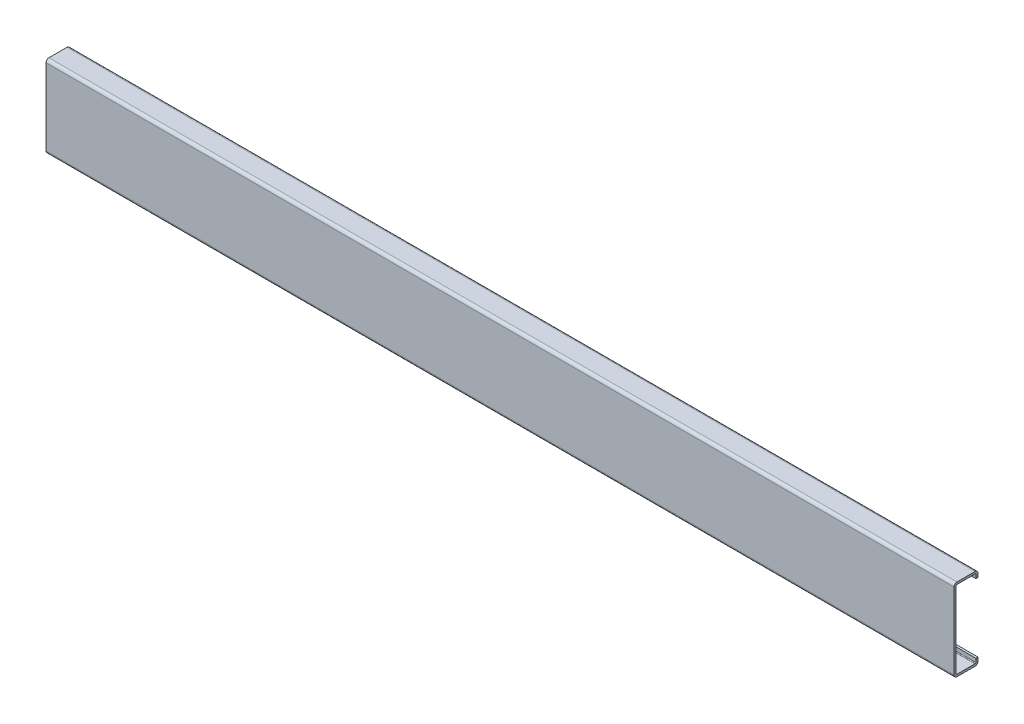
ISO-10303-21;
HEADER;
FILE_DESCRIPTION(('STEP AP214'),'2;1');
FILE_NAME('part.step','',(''),(''),'','','');
FILE_SCHEMA(('AUTOMOTIVE_DESIGN { 1 0 10303 214 1 1 1 1 }'));
ENDSEC;
DATA;
#1=APPLICATION_CONTEXT('core data for automotive mechanical design processes');
#2=APPLICATION_PROTOCOL_DEFINITION('international standard','automotive_design',2000,#1);
#3=PRODUCT_CONTEXT('',#1,'mechanical');
#4=PRODUCT('Part','Part','',(#3));
#5=PRODUCT_RELATED_PRODUCT_CATEGORY('part','',(#4));
#6=PRODUCT_DEFINITION_FORMATION('','',#4);
#7=PRODUCT_DEFINITION_CONTEXT('part definition',#1,'design');
#8=PRODUCT_DEFINITION('design','',#6,#7);
#9=PRODUCT_DEFINITION_SHAPE('','',#8);
#10=(LENGTH_UNIT() NAMED_UNIT(*) SI_UNIT(.MILLI.,.METRE.));
#11=(NAMED_UNIT(*) PLANE_ANGLE_UNIT() SI_UNIT($,.RADIAN.));
#12=(NAMED_UNIT(*) SI_UNIT($,.STERADIAN.) SOLID_ANGLE_UNIT());
#13=UNCERTAINTY_MEASURE_WITH_UNIT(LENGTH_MEASURE(1.E-05),#10,'distance_accuracy_value','');
#14=(GEOMETRIC_REPRESENTATION_CONTEXT(3) GLOBAL_UNCERTAINTY_ASSIGNED_CONTEXT((#13)) GLOBAL_UNIT_ASSIGNED_CONTEXT((#10,
#11,#12)) REPRESENTATION_CONTEXT('',''));
#15=CARTESIAN_POINT('',(0.,0.,0.));
#16=DIRECTION('',(0.,0.,1.));
#17=DIRECTION('',(1.,0.,0.));
#18=AXIS2_PLACEMENT_3D('',#15,#16,#17);
#19=CARTESIAN_POINT('',(500.,21.,-11.4));
#20=DIRECTION('',(0.,0.,-1.));
#21=DIRECTION('',(0.,1.,0.));
#22=AXIS2_PLACEMENT_3D('',#19,#20,#21);
#23=PLANE('',#22);
#24=DIRECTION('',(0.,-1.,0.));
#25=VECTOR('',#24,1.);
#26=CARTESIAN_POINT('',(0.,21.,-11.4));
#27=LINE('',#26,#25);
#28=CARTESIAN_POINT('',(0.,21.,-11.4));
#29=VERTEX_POINT('',#28);
#30=CARTESIAN_POINT('',(0.,19.,-11.4));
#31=VERTEX_POINT('',#30);
#32=EDGE_CURVE('E201',#29,#31,#27,.T.);
#33=ORIENTED_EDGE('',*,*,#32,.T.);
#34=DIRECTION('',(-1.,0.,0.));
#35=VECTOR('',#34,1.);
#36=CARTESIAN_POINT('',(500.,19.,-11.4));
#37=LINE('',#36,#35);
#38=CARTESIAN_POINT('',(500.,19.,-11.4));
#39=VERTEX_POINT('',#38);
#40=EDGE_CURVE('E11',#39,#31,#37,.T.);
#41=ORIENTED_EDGE('',*,*,#40,.F.);
#42=DIRECTION('',(0.,-1.,0.));
#43=VECTOR('',#42,1.);
#44=CARTESIAN_POINT('',(500.,21.,-11.4));
#45=LINE('',#44,#43);
#46=CARTESIAN_POINT('',(500.,21.,-11.4));
#47=VERTEX_POINT('',#46);
#48=EDGE_CURVE('E126',#47,#39,#45,.T.);
#49=ORIENTED_EDGE('',*,*,#48,.F.);
#50=DIRECTION('',(-1.,0.,0.));
#51=VECTOR('',#50,1.);
#52=CARTESIAN_POINT('',(500.,21.,-11.4));
#53=LINE('',#52,#51);
#54=EDGE_CURVE('E197',#47,#29,#53,.T.);
#55=ORIENTED_EDGE('',*,*,#54,.T.);
#56=EDGE_LOOP('',(#33,#41,#49,#55));
#57=FACE_BOUND('',#56,.T.);
#58=ADVANCED_FACE('F34',(#57),#23,.F.);
#59=CARTESIAN_POINT('',(500.,19.,-12.6));
#60=DIRECTION('',(0.,-1.,0.));
#61=DIRECTION('',(0.,0.,-1.));
#62=AXIS2_PLACEMENT_3D('',#59,#60,#61);
#63=PLANE('',#62);
#64=DIRECTION('',(0.,0.,1.));
#65=VECTOR('',#64,1.);
#66=CARTESIAN_POINT('',(0.,19.,-12.6));
#67=LINE('',#66,#65);
#68=CARTESIAN_POINT('',(0.,19.,-12.6));
#69=VERTEX_POINT('',#68);
#70=EDGE_CURVE('E204',#69,#31,#67,.T.);
#71=ORIENTED_EDGE('',*,*,#70,.F.);
#72=DIRECTION('',(-1.,0.,0.));
#73=VECTOR('',#72,1.);
#74=CARTESIAN_POINT('',(500.,19.,-12.6));
#75=LINE('',#74,#73);
#76=CARTESIAN_POINT('',(500.,19.,-12.6));
#77=VERTEX_POINT('',#76);
#78=EDGE_CURVE('E42',#77,#69,#75,.T.);
#79=ORIENTED_EDGE('',*,*,#78,.F.);
#80=DIRECTION('',(0.,0.,1.));
#81=VECTOR('',#80,1.);
#82=CARTESIAN_POINT('',(500.,19.,-12.6));
#83=LINE('',#82,#81);
#84=EDGE_CURVE('E306',#77,#39,#83,.T.);
#85=ORIENTED_EDGE('',*,*,#84,.T.);
#86=ORIENTED_EDGE('',*,*,#40,.T.);
#87=EDGE_LOOP('',(#71,#79,#85,#86));
#88=FACE_BOUND('',#87,.T.);
#89=ADVANCED_FACE('F293',(#88),#63,.T.);
#90=CARTESIAN_POINT('',(500.,21.,-12.6));
#91=DIRECTION('',(0.,0.,-1.));
#92=DIRECTION('',(0.,1.,0.));
#93=AXIS2_PLACEMENT_3D('',#90,#91,#92);
#94=PLANE('',#93);
#95=DIRECTION('',(0.,-1.,0.));
#96=VECTOR('',#95,1.);
#97=CARTESIAN_POINT('',(0.,21.,-12.6));
#98=LINE('',#97,#96);
#99=CARTESIAN_POINT('',(0.,21.,-12.6));
#100=VERTEX_POINT('',#99);
#101=EDGE_CURVE('E207',#100,#69,#98,.T.);
#102=ORIENTED_EDGE('',*,*,#101,.F.);
#103=DIRECTION('',(-1.,0.,0.));
#104=VECTOR('',#103,1.);
#105=CARTESIAN_POINT('',(500.,21.,-12.6));
#106=LINE('',#105,#104);
#107=CARTESIAN_POINT('',(500.,21.,-12.6));
#108=VERTEX_POINT('',#107);
#109=EDGE_CURVE('E283',#108,#100,#106,.T.);
#110=ORIENTED_EDGE('',*,*,#109,.F.);
#111=DIRECTION('',(0.,-1.,0.));
#112=VECTOR('',#111,1.);
#113=CARTESIAN_POINT('',(500.,21.,-12.6));
#114=LINE('',#113,#112);
#115=EDGE_CURVE('E290',#108,#77,#114,.T.);
#116=ORIENTED_EDGE('',*,*,#115,.T.);
#117=ORIENTED_EDGE('',*,*,#78,.T.);
#118=EDGE_LOOP('',(#102,#110,#116,#117));
#119=FACE_BOUND('',#118,.T.);
#120=ADVANCED_FACE('F288',(#119),#94,.T.);
#121=CARTESIAN_POINT('',(500.,21.,-11.));
#122=DIRECTION('',(-1.,0.,0.));
#123=DIRECTION('',(0.,0.,1.));
#124=AXIS2_PLACEMENT_3D('',#121,#122,#123);
#125=CYLINDRICAL_SURFACE('',#124,1.6);
#126=CARTESIAN_POINT('',(0.,21.,-11.));
#127=DIRECTION('',(1.,0.,0.));
#128=DIRECTION('',(0.,0.,-1.));
#129=AXIS2_PLACEMENT_3D('',#126,#127,#128);
#130=CIRCLE('',#129,1.6);
#131=CARTESIAN_POINT('',(0.,22.6,-11.));
#132=VERTEX_POINT('',#131);
#133=EDGE_CURVE('E210',#132,#100,#130,.F.);
#134=ORIENTED_EDGE('',*,*,#133,.F.);
#135=DIRECTION('',(-1.,0.,0.));
#136=VECTOR('',#135,1.);
#137=CARTESIAN_POINT('',(500.,22.6,-11.));
#138=LINE('',#137,#136);
#139=CARTESIAN_POINT('',(500.,22.6,-11.));
#140=VERTEX_POINT('',#139);
#141=EDGE_CURVE('E281',#140,#132,#138,.T.);
#142=ORIENTED_EDGE('',*,*,#141,.F.);
#143=CARTESIAN_POINT('',(500.,21.,-11.));
#144=DIRECTION('',(1.,0.,0.));
#145=DIRECTION('',(0.,0.,-1.));
#146=AXIS2_PLACEMENT_3D('',#143,#144,#145);
#147=CIRCLE('',#146,1.6);
#148=EDGE_CURVE('E303',#140,#108,#147,.F.);
#149=ORIENTED_EDGE('',*,*,#148,.T.);
#150=ORIENTED_EDGE('',*,*,#109,.T.);
#151=EDGE_LOOP('',(#134,#142,#149,#150));
#152=FACE_BOUND('',#151,.T.);
#153=ADVANCED_FACE('F300',(#152),#125,.T.);
#154=CARTESIAN_POINT('',(500.,22.6,-1.));
#155=DIRECTION('',(0.,1.,0.));
#156=DIRECTION('',(0.,0.,1.));
#157=AXIS2_PLACEMENT_3D('',#154,#155,#156);
#158=PLANE('',#157);
#159=DIRECTION('',(0.,0.,-1.));
#160=VECTOR('',#159,1.);
#161=CARTESIAN_POINT('',(0.,22.6,-1.));
#162=LINE('',#161,#160);
#163=CARTESIAN_POINT('',(0.,22.6,-1.));
#164=VERTEX_POINT('',#163);
#165=EDGE_CURVE('E213',#164,#132,#162,.T.);
#166=ORIENTED_EDGE('',*,*,#165,.F.);
#167=DIRECTION('',(-1.,0.,0.));
#168=VECTOR('',#167,1.);
#169=CARTESIAN_POINT('',(500.,22.6,-1.));
#170=LINE('',#169,#168);
#171=CARTESIAN_POINT('',(500.,22.6,-1.));
#172=VERTEX_POINT('',#171);
#173=EDGE_CURVE('E279',#172,#164,#170,.T.);
#174=ORIENTED_EDGE('',*,*,#173,.F.);
#175=DIRECTION('',(0.,0.,-1.));
#176=VECTOR('',#175,1.);
#177=CARTESIAN_POINT('',(500.,22.6,-1.));
#178=LINE('',#177,#176);
#179=EDGE_CURVE('E308',#172,#140,#178,.T.);
#180=ORIENTED_EDGE('',*,*,#179,.T.);
#181=ORIENTED_EDGE('',*,*,#141,.T.);
#182=EDGE_LOOP('',(#166,#174,#180,#181));
#183=FACE_BOUND('',#182,.T.);
#184=ADVANCED_FACE('F374',(#183),#158,.T.);
#185=CARTESIAN_POINT('',(500.,21.,-1.));
#186=DIRECTION('',(-1.,0.,0.));
#187=DIRECTION('',(0.,0.,1.));
#188=AXIS2_PLACEMENT_3D('',#185,#186,#187);
#189=CYLINDRICAL_SURFACE('',#188,1.6);
#190=CARTESIAN_POINT('',(0.,21.,-1.));
#191=DIRECTION('',(1.,0.,0.));
#192=DIRECTION('',(0.,0.,-1.));
#193=AXIS2_PLACEMENT_3D('',#190,#191,#192);
#194=CIRCLE('',#193,1.6);
#195=CARTESIAN_POINT('',(0.,21.,0.6));
#196=VERTEX_POINT('',#195);
#197=EDGE_CURVE('E216',#196,#164,#194,.F.);
#198=ORIENTED_EDGE('',*,*,#197,.F.);
#199=DIRECTION('',(-1.,0.,0.));
#200=VECTOR('',#199,1.);
#201=CARTESIAN_POINT('',(500.,21.,0.6));
#202=LINE('',#201,#200);
#203=CARTESIAN_POINT('',(500.,21.,0.6));
#204=VERTEX_POINT('',#203);
#205=EDGE_CURVE('E277',#204,#196,#202,.T.);
#206=ORIENTED_EDGE('',*,*,#205,.F.);
#207=CARTESIAN_POINT('',(500.,21.,-1.));
#208=DIRECTION('',(1.,0.,0.));
#209=DIRECTION('',(0.,0.,-1.));
#210=AXIS2_PLACEMENT_3D('',#207,#208,#209);
#211=CIRCLE('',#210,1.6);
#212=EDGE_CURVE('E314',#204,#172,#211,.F.);
#213=ORIENTED_EDGE('',*,*,#212,.T.);
#214=ORIENTED_EDGE('',*,*,#173,.T.);
#215=EDGE_LOOP('',(#198,#206,#213,#214));
#216=FACE_BOUND('',#215,.T.);
#217=ADVANCED_FACE('F377',(#216),#189,.T.);
#218=CARTESIAN_POINT('',(500.,-21.,0.6));
#219=DIRECTION('',(0.,0.,1.));
#220=DIRECTION('',(1.,0.,0.));
#221=AXIS2_PLACEMENT_3D('',#218,#219,#220);
#222=PLANE('',#221);
#223=DIRECTION('',(0.,1.,0.));
#224=VECTOR('',#223,1.);
#225=CARTESIAN_POINT('',(0.,-21.,0.6));
#226=LINE('',#225,#224);
#227=CARTESIAN_POINT('',(0.,-21.,0.6));
#228=VERTEX_POINT('',#227);
#229=EDGE_CURVE('E219',#228,#196,#226,.T.);
#230=ORIENTED_EDGE('',*,*,#229,.F.);
#231=DIRECTION('',(-1.,0.,0.));
#232=VECTOR('',#231,1.);
#233=CARTESIAN_POINT('',(500.,-21.,0.6));
#234=LINE('',#233,#232);
#235=CARTESIAN_POINT('',(500.,-21.,0.6));
#236=VERTEX_POINT('',#235);
#237=EDGE_CURVE('E275',#236,#228,#234,.T.);
#238=ORIENTED_EDGE('',*,*,#237,.F.);
#239=DIRECTION('',(0.,1.,0.));
#240=VECTOR('',#239,1.);
#241=CARTESIAN_POINT('',(500.,-21.,0.6));
#242=LINE('',#241,#240);
#243=EDGE_CURVE('E317',#236,#204,#242,.T.);
#244=ORIENTED_EDGE('',*,*,#243,.T.);
#245=ORIENTED_EDGE('',*,*,#205,.T.);
#246=EDGE_LOOP('',(#230,#238,#244,#245));
#247=FACE_BOUND('',#246,.T.);
#248=ADVANCED_FACE('F381',(#247),#222,.T.);
#249=CARTESIAN_POINT('',(500.,-21.,-1.));
#250=DIRECTION('',(-1.,0.,0.));
#251=DIRECTION('',(0.,0.,1.));
#252=AXIS2_PLACEMENT_3D('',#249,#250,#251);
#253=CYLINDRICAL_SURFACE('',#252,1.6);
#254=CARTESIAN_POINT('',(0.,-21.,-1.));
#255=DIRECTION('',(1.,0.,0.));
#256=DIRECTION('',(0.,0.,-1.));
#257=AXIS2_PLACEMENT_3D('',#254,#255,#256);
#258=CIRCLE('',#257,1.6);
#259=CARTESIAN_POINT('',(0.,-22.6,-1.));
#260=VERTEX_POINT('',#259);
#261=EDGE_CURVE('E222',#260,#228,#258,.F.);
#262=ORIENTED_EDGE('',*,*,#261,.F.);
#263=DIRECTION('',(-1.,0.,0.));
#264=VECTOR('',#263,1.);
#265=CARTESIAN_POINT('',(500.,-22.6,-1.));
#266=LINE('',#265,#264);
#267=CARTESIAN_POINT('',(500.,-22.6,-1.));
#268=VERTEX_POINT('',#267);
#269=EDGE_CURVE('E273',#268,#260,#266,.T.);
#270=ORIENTED_EDGE('',*,*,#269,.F.);
#271=CARTESIAN_POINT('',(500.,-21.,-1.));
#272=DIRECTION('',(1.,0.,0.));
#273=DIRECTION('',(0.,0.,-1.));
#274=AXIS2_PLACEMENT_3D('',#271,#272,#273);
#275=CIRCLE('',#274,1.6);
#276=EDGE_CURVE('E320',#268,#236,#275,.F.);
#277=ORIENTED_EDGE('',*,*,#276,.T.);
#278=ORIENTED_EDGE('',*,*,#237,.T.);
#279=EDGE_LOOP('',(#262,#270,#277,#278));
#280=FACE_BOUND('',#279,.T.);
#281=ADVANCED_FACE('F385',(#280),#253,.T.);
#282=CARTESIAN_POINT('',(500.,-22.6,-1.));
#283=DIRECTION('',(0.,-1.,0.));
#284=DIRECTION('',(0.,0.,-1.));
#285=AXIS2_PLACEMENT_3D('',#282,#283,#284);
#286=PLANE('',#285);
#287=DIRECTION('',(0.,0.,-1.));
#288=VECTOR('',#287,1.);
#289=CARTESIAN_POINT('',(0.,-22.6,-1.));
#290=LINE('',#289,#288);
#291=CARTESIAN_POINT('',(0.,-22.6,-11.));
#292=VERTEX_POINT('',#291);
#293=EDGE_CURVE('E225',#292,#260,#290,.F.);
#294=ORIENTED_EDGE('',*,*,#293,.F.);
#295=DIRECTION('',(-1.,0.,0.));
#296=VECTOR('',#295,1.);
#297=CARTESIAN_POINT('',(500.,-22.6,-11.));
#298=LINE('',#297,#296);
#299=CARTESIAN_POINT('',(500.,-22.6,-11.));
#300=VERTEX_POINT('',#299);
#301=EDGE_CURVE('E271',#300,#292,#298,.T.);
#302=ORIENTED_EDGE('',*,*,#301,.F.);
#303=DIRECTION('',(0.,0.,-1.));
#304=VECTOR('',#303,1.);
#305=CARTESIAN_POINT('',(500.,-22.6,-1.));
#306=LINE('',#305,#304);
#307=EDGE_CURVE('E323',#300,#268,#306,.F.);
#308=ORIENTED_EDGE('',*,*,#307,.T.);
#309=ORIENTED_EDGE('',*,*,#269,.T.);
#310=EDGE_LOOP('',(#294,#302,#308,#309));
#311=FACE_BOUND('',#310,.T.);
#312=ADVANCED_FACE('F389',(#311),#286,.T.);
#313=CARTESIAN_POINT('',(500.,-21.,-11.));
#314=DIRECTION('',(-1.,0.,0.));
#315=DIRECTION('',(0.,0.,1.));
#316=AXIS2_PLACEMENT_3D('',#313,#314,#315);
#317=CYLINDRICAL_SURFACE('',#316,1.6);
#318=CARTESIAN_POINT('',(0.,-21.,-11.));
#319=DIRECTION('',(1.,0.,0.));
#320=DIRECTION('',(0.,0.,-1.));
#321=AXIS2_PLACEMENT_3D('',#318,#319,#320);
#322=CIRCLE('',#321,1.6);
#323=CARTESIAN_POINT('',(0.,-21.,-12.6));
#324=VERTEX_POINT('',#323);
#325=EDGE_CURVE('E228',#324,#292,#322,.F.);
#326=ORIENTED_EDGE('',*,*,#325,.F.);
#327=DIRECTION('',(-1.,0.,0.));
#328=VECTOR('',#327,1.);
#329=CARTESIAN_POINT('',(500.,-21.,-12.6));
#330=LINE('',#329,#328);
#331=CARTESIAN_POINT('',(500.,-21.,-12.6));
#332=VERTEX_POINT('',#331);
#333=EDGE_CURVE('E269',#332,#324,#330,.T.);
#334=ORIENTED_EDGE('',*,*,#333,.F.);
#335=CARTESIAN_POINT('',(500.,-21.,-11.));
#336=DIRECTION('',(1.,0.,0.));
#337=DIRECTION('',(0.,0.,-1.));
#338=AXIS2_PLACEMENT_3D('',#335,#336,#337);
#339=CIRCLE('',#338,1.6);
#340=EDGE_CURVE('E326',#332,#300,#339,.F.);
#341=ORIENTED_EDGE('',*,*,#340,.T.);
#342=ORIENTED_EDGE('',*,*,#301,.T.);
#343=EDGE_LOOP('',(#326,#334,#341,#342));
#344=FACE_BOUND('',#343,.T.);
#345=ADVANCED_FACE('F393',(#344),#317,.T.);
#346=CARTESIAN_POINT('',(500.,-21.,-12.6));
#347=DIRECTION('',(0.,0.,-1.));
#348=DIRECTION('',(0.,1.,0.));
#349=AXIS2_PLACEMENT_3D('',#346,#347,#348);
#350=PLANE('',#349);
#351=DIRECTION('',(0.,-1.,0.));
#352=VECTOR('',#351,1.);
#353=CARTESIAN_POINT('',(0.,-21.,-12.6));
#354=LINE('',#353,#352);
#355=CARTESIAN_POINT('',(0.,-19.,-12.6));
#356=VERTEX_POINT('',#355);
#357=EDGE_CURVE('E231',#356,#324,#354,.T.);
#358=ORIENTED_EDGE('',*,*,#357,.F.);
#359=DIRECTION('',(-1.,0.,0.));
#360=VECTOR('',#359,1.);
#361=CARTESIAN_POINT('',(500.,-19.,-12.6));
#362=LINE('',#361,#360);
#363=CARTESIAN_POINT('',(500.,-19.,-12.6));
#364=VERTEX_POINT('',#363);
#365=EDGE_CURVE('E267',#364,#356,#362,.T.);
#366=ORIENTED_EDGE('',*,*,#365,.F.);
#367=DIRECTION('',(0.,-1.,0.));
#368=VECTOR('',#367,1.);
#369=CARTESIAN_POINT('',(500.,-21.,-12.6));
#370=LINE('',#369,#368);
#371=EDGE_CURVE('E329',#364,#332,#370,.T.);
#372=ORIENTED_EDGE('',*,*,#371,.T.);
#373=ORIENTED_EDGE('',*,*,#333,.T.);
#374=EDGE_LOOP('',(#358,#366,#372,#373));
#375=FACE_BOUND('',#374,.T.);
#376=ADVANCED_FACE('F397',(#375),#350,.T.);
#377=CARTESIAN_POINT('',(500.,-19.,-11.4));
#378=DIRECTION('',(0.,1.,0.));
#379=DIRECTION('',(0.,0.,1.));
#380=AXIS2_PLACEMENT_3D('',#377,#378,#379);
#381=PLANE('',#380);
#382=DIRECTION('',(0.,0.,-1.));
#383=VECTOR('',#382,1.);
#384=CARTESIAN_POINT('',(0.,-19.,-11.4));
#385=LINE('',#384,#383);
#386=CARTESIAN_POINT('',(0.,-19.,-11.4));
#387=VERTEX_POINT('',#386);
#388=EDGE_CURVE('E234',#387,#356,#385,.T.);
#389=ORIENTED_EDGE('',*,*,#388,.F.);
#390=DIRECTION('',(-1.,0.,0.));
#391=VECTOR('',#390,1.);
#392=CARTESIAN_POINT('',(500.,-19.,-11.4));
#393=LINE('',#392,#391);
#394=CARTESIAN_POINT('',(500.,-19.,-11.4));
#395=VERTEX_POINT('',#394);
#396=EDGE_CURVE('E265',#395,#387,#393,.T.);
#397=ORIENTED_EDGE('',*,*,#396,.F.);
#398=DIRECTION('',(0.,0.,-1.));
#399=VECTOR('',#398,1.);
#400=CARTESIAN_POINT('',(500.,-19.,-11.4));
#401=LINE('',#400,#399);
#402=EDGE_CURVE('E332',#395,#364,#401,.T.);
#403=ORIENTED_EDGE('',*,*,#402,.T.);
#404=ORIENTED_EDGE('',*,*,#365,.T.);
#405=EDGE_LOOP('',(#389,#397,#403,#404));
#406=FACE_BOUND('',#405,.T.);
#407=ADVANCED_FACE('F401',(#406),#381,.T.);
#408=CARTESIAN_POINT('',(500.,-21.,-11.4));
#409=DIRECTION('',(0.,0.,-1.));
#410=DIRECTION('',(0.,1.,0.));
#411=AXIS2_PLACEMENT_3D('',#408,#409,#410);
#412=PLANE('',#411);
#413=DIRECTION('',(0.,-1.,0.));
#414=VECTOR('',#413,1.);
#415=CARTESIAN_POINT('',(0.,-21.,-11.4));
#416=LINE('',#415,#414);
#417=CARTESIAN_POINT('',(0.,-21.,-11.4));
#418=VERTEX_POINT('',#417);
#419=EDGE_CURVE('E237',#387,#418,#416,.T.);
#420=ORIENTED_EDGE('',*,*,#419,.T.);
#421=DIRECTION('',(-1.,0.,0.));
#422=VECTOR('',#421,1.);
#423=CARTESIAN_POINT('',(500.,-21.,-11.4));
#424=LINE('',#423,#422);
#425=CARTESIAN_POINT('',(500.,-21.,-11.4));
#426=VERTEX_POINT('',#425);
#427=EDGE_CURVE('E262',#426,#418,#424,.T.);
#428=ORIENTED_EDGE('',*,*,#427,.F.);
#429=DIRECTION('',(0.,-1.,0.));
#430=VECTOR('',#429,1.);
#431=CARTESIAN_POINT('',(500.,-21.,-11.4));
#432=LINE('',#431,#430);
#433=EDGE_CURVE('E335',#395,#426,#432,.T.);
#434=ORIENTED_EDGE('',*,*,#433,.F.);
#435=ORIENTED_EDGE('',*,*,#396,.T.);
#436=EDGE_LOOP('',(#420,#428,#434,#435));
#437=FACE_BOUND('',#436,.T.);
#438=ADVANCED_FACE('F405',(#437),#412,.F.);
#439=CARTESIAN_POINT('',(500.,-21.,-11.));
#440=DIRECTION('',(-1.,0.,0.));
#441=DIRECTION('',(0.,0.,1.));
#442=AXIS2_PLACEMENT_3D('',#439,#440,#441);
#443=CYLINDRICAL_SURFACE('',#442,0.400000000000003);
#444=CARTESIAN_POINT('',(0.,-21.,-11.));
#445=DIRECTION('',(1.,0.,0.));
#446=DIRECTION('',(0.,0.,-1.));
#447=AXIS2_PLACEMENT_3D('',#444,#445,#446);
#448=CIRCLE('',#447,0.400000000000003);
#449=CARTESIAN_POINT('',(0.,-21.4,-11.));
#450=VERTEX_POINT('',#449);
#451=EDGE_CURVE('E239',#418,#450,#448,.F.);
#452=ORIENTED_EDGE('',*,*,#451,.T.);
#453=DIRECTION('',(-1.,0.,0.));
#454=VECTOR('',#453,1.);
#455=CARTESIAN_POINT('',(500.,-21.4,-11.));
#456=LINE('',#455,#454);
#457=CARTESIAN_POINT('',(500.,-21.4,-11.));
#458=VERTEX_POINT('',#457);
#459=EDGE_CURVE('E259',#458,#450,#456,.T.);
#460=ORIENTED_EDGE('',*,*,#459,.F.);
#461=CARTESIAN_POINT('',(500.,-21.,-11.));
#462=DIRECTION('',(1.,0.,0.));
#463=DIRECTION('',(0.,0.,-1.));
#464=AXIS2_PLACEMENT_3D('',#461,#462,#463);
#465=CIRCLE('',#464,0.400000000000003);
#466=EDGE_CURVE('E337',#426,#458,#465,.F.);
#467=ORIENTED_EDGE('',*,*,#466,.F.);
#468=ORIENTED_EDGE('',*,*,#427,.T.);
#469=EDGE_LOOP('',(#452,#460,#467,#468));
#470=FACE_BOUND('',#469,.T.);
#471=ADVANCED_FACE('F409',(#470),#443,.F.);
#472=CARTESIAN_POINT('',(500.,-21.4,-1.));
#473=DIRECTION('',(0.,-1.,0.));
#474=DIRECTION('',(0.,0.,-1.));
#475=AXIS2_PLACEMENT_3D('',#472,#473,#474);
#476=PLANE('',#475);
#477=DIRECTION('',(0.,0.,-1.));
#478=VECTOR('',#477,1.);
#479=CARTESIAN_POINT('',(0.,-21.4,-1.));
#480=LINE('',#479,#478);
#481=CARTESIAN_POINT('',(0.,-21.4,-1.));
#482=VERTEX_POINT('',#481);
#483=EDGE_CURVE('E241',#450,#482,#480,.F.);
#484=ORIENTED_EDGE('',*,*,#483,.T.);
#485=DIRECTION('',(-1.,0.,0.));
#486=VECTOR('',#485,1.);
#487=CARTESIAN_POINT('',(500.,-21.4,-1.));
#488=LINE('',#487,#486);
#489=CARTESIAN_POINT('',(500.,-21.4,-1.));
#490=VERTEX_POINT('',#489);
#491=EDGE_CURVE('E256',#490,#482,#488,.T.);
#492=ORIENTED_EDGE('',*,*,#491,.F.);
#493=DIRECTION('',(0.,0.,-1.));
#494=VECTOR('',#493,1.);
#495=CARTESIAN_POINT('',(500.,-21.4,-1.));
#496=LINE('',#495,#494);
#497=EDGE_CURVE('E339',#458,#490,#496,.F.);
#498=ORIENTED_EDGE('',*,*,#497,.F.);
#499=ORIENTED_EDGE('',*,*,#459,.T.);
#500=EDGE_LOOP('',(#484,#492,#498,#499));
#501=FACE_BOUND('',#500,.T.);
#502=ADVANCED_FACE('F413',(#501),#476,.F.);
#503=CARTESIAN_POINT('',(500.,-21.,-1.));
#504=DIRECTION('',(-1.,0.,0.));
#505=DIRECTION('',(0.,0.,1.));
#506=AXIS2_PLACEMENT_3D('',#503,#504,#505);
#507=CYLINDRICAL_SURFACE('',#506,0.400000000000001);
#508=CARTESIAN_POINT('',(0.,-21.,-1.));
#509=DIRECTION('',(1.,0.,0.));
#510=DIRECTION('',(0.,0.,-1.));
#511=AXIS2_PLACEMENT_3D('',#508,#509,#510);
#512=CIRCLE('',#511,0.400000000000001);
#513=CARTESIAN_POINT('',(0.,-21.,-0.6));
#514=VERTEX_POINT('',#513);
#515=EDGE_CURVE('E243',#482,#514,#512,.F.);
#516=ORIENTED_EDGE('',*,*,#515,.T.);
#517=DIRECTION('',(-1.,0.,0.));
#518=VECTOR('',#517,1.);
#519=CARTESIAN_POINT('',(500.,-21.,-0.6));
#520=LINE('',#519,#518);
#521=CARTESIAN_POINT('',(500.,-21.,-0.6));
#522=VERTEX_POINT('',#521);
#523=EDGE_CURVE('E253',#522,#514,#520,.T.);
#524=ORIENTED_EDGE('',*,*,#523,.F.);
#525=CARTESIAN_POINT('',(500.,-21.,-1.));
#526=DIRECTION('',(1.,0.,0.));
#527=DIRECTION('',(0.,0.,-1.));
#528=AXIS2_PLACEMENT_3D('',#525,#526,#527);
#529=CIRCLE('',#528,0.400000000000001);
#530=EDGE_CURVE('E341',#490,#522,#529,.F.);
#531=ORIENTED_EDGE('',*,*,#530,.F.);
#532=ORIENTED_EDGE('',*,*,#491,.T.);
#533=EDGE_LOOP('',(#516,#524,#531,#532));
#534=FACE_BOUND('',#533,.T.);
#535=ADVANCED_FACE('F347',(#534),#507,.F.);
#536=CARTESIAN_POINT('',(500.,-21.,-0.6));
#537=DIRECTION('',(0.,0.,1.));
#538=DIRECTION('',(1.,0.,0.));
#539=AXIS2_PLACEMENT_3D('',#536,#537,#538);
#540=PLANE('',#539);
#541=DIRECTION('',(0.,1.,0.));
#542=VECTOR('',#541,1.);
#543=CARTESIAN_POINT('',(0.,-21.,-0.6));
#544=LINE('',#543,#542);
#545=CARTESIAN_POINT('',(0.,21.,-0.6));
#546=VERTEX_POINT('',#545);
#547=EDGE_CURVE('E245',#514,#546,#544,.T.);
#548=ORIENTED_EDGE('',*,*,#547,.T.);
#549=DIRECTION('',(-1.,0.,0.));
#550=VECTOR('',#549,1.);
#551=CARTESIAN_POINT('',(500.,21.,-0.6));
#552=LINE('',#551,#550);
#553=CARTESIAN_POINT('',(500.,21.,-0.6));
#554=VERTEX_POINT('',#553);
#555=EDGE_CURVE('E192',#554,#546,#552,.T.);
#556=ORIENTED_EDGE('',*,*,#555,.F.);
#557=DIRECTION('',(0.,1.,0.));
#558=VECTOR('',#557,1.);
#559=CARTESIAN_POINT('',(500.,-21.,-0.6));
#560=LINE('',#559,#558);
#561=EDGE_CURVE('E183',#522,#554,#560,.T.);
#562=ORIENTED_EDGE('',*,*,#561,.F.);
#563=ORIENTED_EDGE('',*,*,#523,.T.);
#564=EDGE_LOOP('',(#548,#556,#562,#563));
#565=FACE_BOUND('',#564,.T.);
#566=ADVANCED_FACE('F351',(#565),#540,.F.);
#567=CARTESIAN_POINT('',(500.,21.,-1.));
#568=DIRECTION('',(-1.,0.,0.));
#569=DIRECTION('',(0.,0.,1.));
#570=AXIS2_PLACEMENT_3D('',#567,#568,#569);
#571=CYLINDRICAL_SURFACE('',#570,0.400000000000001);
#572=CARTESIAN_POINT('',(0.,21.,-1.));
#573=DIRECTION('',(1.,0.,0.));
#574=DIRECTION('',(0.,0.,-1.));
#575=AXIS2_PLACEMENT_3D('',#572,#573,#574);
#576=CIRCLE('',#575,0.400000000000001);
#577=CARTESIAN_POINT('',(0.,21.4,-1.));
#578=VERTEX_POINT('',#577);
#579=EDGE_CURVE('E191',#546,#578,#576,.F.);
#580=ORIENTED_EDGE('',*,*,#579,.T.);
#581=DIRECTION('',(-1.,0.,0.));
#582=VECTOR('',#581,1.);
#583=CARTESIAN_POINT('',(500.,21.4,-1.));
#584=LINE('',#583,#582);
#585=CARTESIAN_POINT('',(500.,21.4,-1.));
#586=VERTEX_POINT('',#585);
#587=EDGE_CURVE('E188',#586,#578,#584,.T.);
#588=ORIENTED_EDGE('',*,*,#587,.F.);
#589=CARTESIAN_POINT('',(500.,21.,-1.));
#590=DIRECTION('',(1.,0.,0.));
#591=DIRECTION('',(0.,0.,-1.));
#592=AXIS2_PLACEMENT_3D('',#589,#590,#591);
#593=CIRCLE('',#592,0.400000000000001);
#594=EDGE_CURVE('E177',#554,#586,#593,.F.);
#595=ORIENTED_EDGE('',*,*,#594,.F.);
#596=ORIENTED_EDGE('',*,*,#555,.T.);
#597=EDGE_LOOP('',(#580,#588,#595,#596));
#598=FACE_BOUND('',#597,.T.);
#599=ADVANCED_FACE('F189',(#598),#571,.F.);
#600=CARTESIAN_POINT('',(500.,21.4,-1.));
#601=DIRECTION('',(0.,1.,0.));
#602=DIRECTION('',(0.,0.,1.));
#603=AXIS2_PLACEMENT_3D('',#600,#601,#602);
#604=PLANE('',#603);
#605=DIRECTION('',(0.,0.,-1.));
#606=VECTOR('',#605,1.);
#607=CARTESIAN_POINT('',(0.,21.4,-1.));
#608=LINE('',#607,#606);
#609=CARTESIAN_POINT('',(0.,21.4,-11.));
#610=VERTEX_POINT('',#609);
#611=EDGE_CURVE('E114',#578,#610,#608,.T.);
#612=ORIENTED_EDGE('',*,*,#611,.T.);
#613=DIRECTION('',(-1.,0.,0.));
#614=VECTOR('',#613,1.);
#615=CARTESIAN_POINT('',(500.,21.4,-11.));
#616=LINE('',#615,#614);
#617=CARTESIAN_POINT('',(500.,21.4,-11.));
#618=VERTEX_POINT('',#617);
#619=EDGE_CURVE('E193',#618,#610,#616,.T.);
#620=ORIENTED_EDGE('',*,*,#619,.F.);
#621=DIRECTION('',(0.,0.,-1.));
#622=VECTOR('',#621,1.);
#623=CARTESIAN_POINT('',(500.,21.4,-1.));
#624=LINE('',#623,#622);
#625=EDGE_CURVE('E181',#586,#618,#624,.T.);
#626=ORIENTED_EDGE('',*,*,#625,.F.);
#627=ORIENTED_EDGE('',*,*,#587,.T.);
#628=EDGE_LOOP('',(#612,#620,#626,#627));
#629=FACE_BOUND('',#628,.T.);
#630=ADVANCED_FACE('F195',(#629),#604,.F.);
#631=CARTESIAN_POINT('',(500.,21.,-11.));
#632=DIRECTION('',(-1.,0.,0.));
#633=DIRECTION('',(0.,0.,1.));
#634=AXIS2_PLACEMENT_3D('',#631,#632,#633);
#635=CYLINDRICAL_SURFACE('',#634,0.400000000000003);
#636=CARTESIAN_POINT('',(0.,21.,-11.));
#637=DIRECTION('',(1.,0.,0.));
#638=DIRECTION('',(0.,0.,-1.));
#639=AXIS2_PLACEMENT_3D('',#636,#637,#638);
#640=CIRCLE('',#639,0.400000000000003);
#641=EDGE_CURVE('E120',#610,#29,#640,.F.);
#642=ORIENTED_EDGE('',*,*,#641,.T.);
#643=ORIENTED_EDGE('',*,*,#54,.F.);
#644=CARTESIAN_POINT('',(500.,21.,-11.));
#645=DIRECTION('',(1.,0.,0.));
#646=DIRECTION('',(0.,0.,-1.));
#647=AXIS2_PLACEMENT_3D('',#644,#645,#646);
#648=CIRCLE('',#647,0.400000000000003);
#649=EDGE_CURVE('E50',#618,#47,#648,.F.);
#650=ORIENTED_EDGE('',*,*,#649,.F.);
#651=ORIENTED_EDGE('',*,*,#619,.T.);
#652=EDGE_LOOP('',(#642,#643,#650,#651));
#653=FACE_BOUND('',#652,.T.);
#654=ADVANCED_FACE('F353',(#653),#635,.F.);
#655=CARTESIAN_POINT('',(500.,21.,-11.));
#656=DIRECTION('',(1.,0.,0.));
#657=DIRECTION('',(0.,0.,-1.));
#658=AXIS2_PLACEMENT_3D('',#655,#656,#657);
#659=PLANE('',#658);
#660=ORIENTED_EDGE('',*,*,#48,.T.);
#661=ORIENTED_EDGE('',*,*,#84,.F.);
#662=ORIENTED_EDGE('',*,*,#115,.F.);
#663=ORIENTED_EDGE('',*,*,#148,.F.);
#664=ORIENTED_EDGE('',*,*,#179,.F.);
#665=ORIENTED_EDGE('',*,*,#212,.F.);
#666=ORIENTED_EDGE('',*,*,#243,.F.);
#667=ORIENTED_EDGE('',*,*,#276,.F.);
#668=ORIENTED_EDGE('',*,*,#307,.F.);
#669=ORIENTED_EDGE('',*,*,#340,.F.);
#670=ORIENTED_EDGE('',*,*,#371,.F.);
#671=ORIENTED_EDGE('',*,*,#402,.F.);
#672=ORIENTED_EDGE('',*,*,#433,.T.);
#673=ORIENTED_EDGE('',*,*,#466,.T.);
#674=ORIENTED_EDGE('',*,*,#497,.T.);
#675=ORIENTED_EDGE('',*,*,#530,.T.);
#676=ORIENTED_EDGE('',*,*,#561,.T.);
#677=ORIENTED_EDGE('',*,*,#594,.T.);
#678=ORIENTED_EDGE('',*,*,#625,.T.);
#679=ORIENTED_EDGE('',*,*,#649,.T.);
#680=EDGE_LOOP('',(#660,#661,#662,#663,#664,#665,#666,#667,#668,#669,#670,#671,#672,#673,#674,
#675,#676,#677,#678,#679));
#681=FACE_BOUND('',#680,.T.);
#682=ADVANCED_FACE('F179',(#681),#659,.T.);
#683=CARTESIAN_POINT('',(0.,21.,-11.));
#684=DIRECTION('',(1.,0.,0.));
#685=DIRECTION('',(0.,0.,-1.));
#686=AXIS2_PLACEMENT_3D('',#683,#684,#685);
#687=PLANE('',#686);
#688=ORIENTED_EDGE('',*,*,#32,.F.);
#689=ORIENTED_EDGE('',*,*,#641,.F.);
#690=ORIENTED_EDGE('',*,*,#611,.F.);
#691=ORIENTED_EDGE('',*,*,#579,.F.);
#692=ORIENTED_EDGE('',*,*,#547,.F.);
#693=ORIENTED_EDGE('',*,*,#515,.F.);
#694=ORIENTED_EDGE('',*,*,#483,.F.);
#695=ORIENTED_EDGE('',*,*,#451,.F.);
#696=ORIENTED_EDGE('',*,*,#419,.F.);
#697=ORIENTED_EDGE('',*,*,#388,.T.);
#698=ORIENTED_EDGE('',*,*,#357,.T.);
#699=ORIENTED_EDGE('',*,*,#325,.T.);
#700=ORIENTED_EDGE('',*,*,#293,.T.);
#701=ORIENTED_EDGE('',*,*,#261,.T.);
#702=ORIENTED_EDGE('',*,*,#229,.T.);
#703=ORIENTED_EDGE('',*,*,#197,.T.);
#704=ORIENTED_EDGE('',*,*,#165,.T.);
#705=ORIENTED_EDGE('',*,*,#133,.T.);
#706=ORIENTED_EDGE('',*,*,#101,.T.);
#707=ORIENTED_EDGE('',*,*,#70,.T.);
#708=EDGE_LOOP('',(#688,#689,#690,#691,#692,#693,#694,#695,#696,#697,#698,#699,#700,#701,#702,
#703,#704,#705,#706,#707));
#709=FACE_BOUND('',#708,.T.);
#710=ADVANCED_FACE('F296',(#709),#687,.F.);
#711=CLOSED_SHELL('',(#58,#89,#120,#153,#184,#217,#248,#281,#312,#345,#376,#407,#438,#471,#502,
#535,#566,#599,#630,#654,#682,#710));
#712=MANIFOLD_SOLID_BREP('B2',#711);
#713=ADVANCED_BREP_SHAPE_REPRESENTATION('',(#18,#712),#14);
#714=SHAPE_DEFINITION_REPRESENTATION(#9,#713);
ENDSEC;
END-ISO-10303-21;
